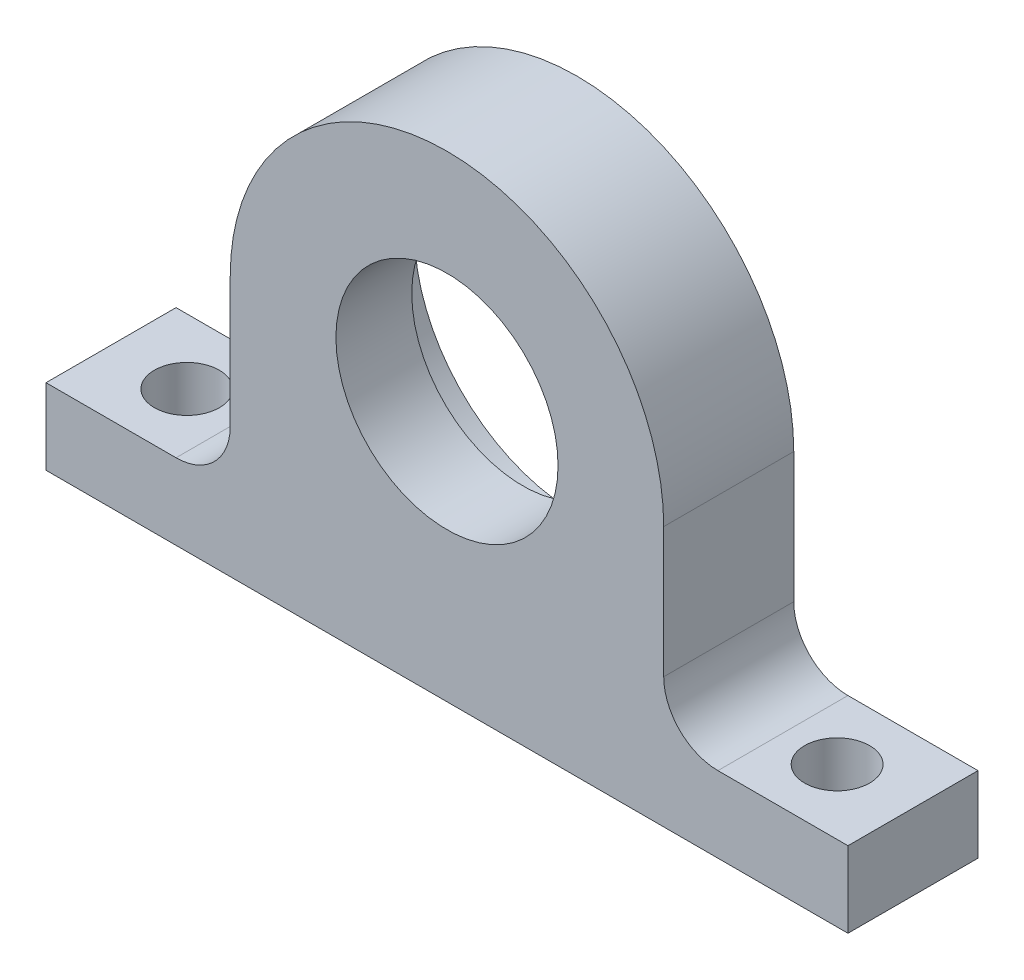
ISO-10303-21;
HEADER;
FILE_DESCRIPTION(('STEP AP214'),'2;1');
FILE_NAME('part.step','',(''),(''),'','','');
FILE_SCHEMA(('AUTOMOTIVE_DESIGN { 1 0 10303 214 1 1 1 1 }'));
ENDSEC;
DATA;
#1=APPLICATION_CONTEXT('core data for automotive mechanical design processes');
#2=APPLICATION_PROTOCOL_DEFINITION('international standard','automotive_design',2000,#1);
#3=PRODUCT_CONTEXT('',#1,'mechanical');
#4=PRODUCT('Part','Part','',(#3));
#5=PRODUCT_RELATED_PRODUCT_CATEGORY('part','',(#4));
#6=PRODUCT_DEFINITION_FORMATION('','',#4);
#7=PRODUCT_DEFINITION_CONTEXT('part definition',#1,'design');
#8=PRODUCT_DEFINITION('design','',#6,#7);
#9=PRODUCT_DEFINITION_SHAPE('','',#8);
#10=(LENGTH_UNIT() NAMED_UNIT(*) SI_UNIT(.MILLI.,.METRE.));
#11=(NAMED_UNIT(*) PLANE_ANGLE_UNIT() SI_UNIT($,.RADIAN.));
#12=(NAMED_UNIT(*) SI_UNIT($,.STERADIAN.) SOLID_ANGLE_UNIT());
#13=UNCERTAINTY_MEASURE_WITH_UNIT(LENGTH_MEASURE(1.E-05),#10,'distance_accuracy_value','');
#14=(GEOMETRIC_REPRESENTATION_CONTEXT(3) GLOBAL_UNCERTAINTY_ASSIGNED_CONTEXT((#13)) GLOBAL_UNIT_ASSIGNED_CONTEXT((#10,
#11,#12)) REPRESENTATION_CONTEXT('',''));
#15=CARTESIAN_POINT('',(0.,0.,0.));
#16=DIRECTION('',(0.,0.,1.));
#17=DIRECTION('',(1.,0.,0.));
#18=AXIS2_PLACEMENT_3D('',#15,#16,#17);
#19=CARTESIAN_POINT('',(0.,0.,12.));
#20=DIRECTION('',(0.,0.,-1.));
#21=DIRECTION('',(-1.,0.,0.));
#22=AXIS2_PLACEMENT_3D('',#19,#20,#21);
#23=CYLINDRICAL_SURFACE('',#22,20.);
#24=CARTESIAN_POINT('',(0.,0.,12.));
#25=DIRECTION('',(0.,0.,1.));
#26=DIRECTION('',(1.,0.,0.));
#27=AXIS2_PLACEMENT_3D('',#24,#25,#26);
#28=CIRCLE('',#27,20.);
#29=CARTESIAN_POINT('',(20.,-1.43982048506075E-13,12.));
#30=VERTEX_POINT('',#29);
#31=CARTESIAN_POINT('',(-20.,-1.35308431126191E-13,12.));
#32=VERTEX_POINT('',#31);
#33=EDGE_CURVE('E120',#30,#32,#28,.T.);
#34=ORIENTED_EDGE('',*,*,#33,.F.);
#35=DIRECTION('',(0.,0.,-1.));
#36=VECTOR('',#35,1.);
#37=CARTESIAN_POINT('',(20.,-1.39659253553725E-13,12.));
#38=LINE('',#37,#36);
#39=CARTESIAN_POINT('',(20.,-1.43982048506075E-13,0.));
#40=VERTEX_POINT('',#39);
#41=EDGE_CURVE('E191',#30,#40,#38,.T.);
#42=ORIENTED_EDGE('',*,*,#41,.T.);
#43=CARTESIAN_POINT('',(0.,0.,0.));
#44=DIRECTION('',(0.,0.,1.));
#45=DIRECTION('',(1.,0.,0.));
#46=AXIS2_PLACEMENT_3D('',#43,#44,#45);
#47=CIRCLE('',#46,20.);
#48=CARTESIAN_POINT('',(-20.,-1.35308431126191E-13,0.));
#49=VERTEX_POINT('',#48);
#50=EDGE_CURVE('E224',#40,#49,#47,.T.);
#51=ORIENTED_EDGE('',*,*,#50,.T.);
#52=DIRECTION('',(0.,0.,-1.));
#53=VECTOR('',#52,1.);
#54=CARTESIAN_POINT('',(-20.,-1.34760666357136E-13,12.));
#55=LINE('',#54,#53);
#56=EDGE_CURVE('E190',#32,#49,#55,.T.);
#57=ORIENTED_EDGE('',*,*,#56,.F.);
#58=EDGE_LOOP('',(#34,#42,#51,#57));
#59=FACE_BOUND('',#58,.T.);
#60=ADVANCED_FACE('F39',(#59),#23,.T.);
#61=CARTESIAN_POINT('',(0.,0.,12.));
#62=DIRECTION('',(0.,0.,-1.));
#63=DIRECTION('',(-1.,0.,0.));
#64=AXIS2_PLACEMENT_3D('',#61,#62,#63);
#65=CYLINDRICAL_SURFACE('',#64,10.25);
#66=CARTESIAN_POINT('',(0.,0.,12.));
#67=DIRECTION('',(0.,0.,1.));
#68=DIRECTION('',(1.,0.,0.));
#69=AXIS2_PLACEMENT_3D('',#66,#67,#68);
#70=CIRCLE('',#69,10.25);
#71=CARTESIAN_POINT('',(10.25,0.,12.));
#72=VERTEX_POINT('',#71);
#73=EDGE_CURVE('E212',#72,#72,#70,.T.);
#74=ORIENTED_EDGE('',*,*,#73,.T.);
#75=EDGE_LOOP('',(#74));
#76=FACE_BOUND('',#75,.T.);
#77=CARTESIAN_POINT('',(0.,0.,5.));
#78=DIRECTION('',(0.,0.,-1.));
#79=DIRECTION('',(-1.,0.,0.));
#80=AXIS2_PLACEMENT_3D('',#77,#78,#79);
#81=CIRCLE('',#80,10.25);
#82=CARTESIAN_POINT('',(-10.25,0.,5.));
#83=VERTEX_POINT('',#82);
#84=EDGE_CURVE('E148',#83,#83,#81,.T.);
#85=ORIENTED_EDGE('',*,*,#84,.T.);
#86=EDGE_LOOP('',(#85));
#87=FACE_BOUND('',#86,.T.);
#88=ADVANCED_FACE('F249',(#76,#87),#65,.F.);
#89=CARTESIAN_POINT('',(0.,0.,12.));
#90=DIRECTION('',(0.,0.,1.));
#91=DIRECTION('',(1.,0.,0.));
#92=AXIS2_PLACEMENT_3D('',#89,#90,#91);
#93=PLANE('',#92);
#94=DIRECTION('',(0.,-1.,0.));
#95=VECTOR('',#94,1.);
#96=CARTESIAN_POINT('',(20.,-1.39659253553725E-13,12.));
#97=LINE('',#96,#95);
#98=CARTESIAN_POINT('',(20.,-12.,12.));
#99=VERTEX_POINT('',#98);
#100=EDGE_CURVE('E194',#30,#99,#97,.T.);
#101=ORIENTED_EDGE('',*,*,#100,.F.);
#102=ORIENTED_EDGE('',*,*,#33,.T.);
#103=DIRECTION('',(0.,1.,0.));
#104=VECTOR('',#103,1.);
#105=CARTESIAN_POINT('',(-20.,-1.34760666357136E-13,12.));
#106=LINE('',#105,#104);
#107=CARTESIAN_POINT('',(-20.,-12.,12.));
#108=VERTEX_POINT('',#107);
#109=EDGE_CURVE('E167',#108,#32,#106,.T.);
#110=ORIENTED_EDGE('',*,*,#109,.F.);
#111=CARTESIAN_POINT('',(-25.,-12.,12.));
#112=DIRECTION('',(0.,0.,1.));
#113=DIRECTION('',(1.,0.,0.));
#114=AXIS2_PLACEMENT_3D('',#111,#112,#113);
#115=CIRCLE('',#114,5.);
#116=CARTESIAN_POINT('',(-25.,-17.,12.));
#117=VERTEX_POINT('',#116);
#118=EDGE_CURVE('E160',#108,#117,#115,.F.);
#119=ORIENTED_EDGE('',*,*,#118,.T.);
#120=DIRECTION('',(-1.,0.,0.));
#121=VECTOR('',#120,1.);
#122=CARTESIAN_POINT('',(-10.5356537528527,-17.,12.));
#123=LINE('',#122,#121);
#124=CARTESIAN_POINT('',(-37.,-17.,12.));
#125=VERTEX_POINT('',#124);
#126=EDGE_CURVE('E164',#117,#125,#123,.T.);
#127=ORIENTED_EDGE('',*,*,#126,.T.);
#128=DIRECTION('',(0.,-1.,0.));
#129=VECTOR('',#128,1.);
#130=CARTESIAN_POINT('',(-37.,-17.,12.));
#131=LINE('',#130,#129);
#132=CARTESIAN_POINT('',(-37.,-24.,12.));
#133=VERTEX_POINT('',#132);
#134=EDGE_CURVE('E175',#125,#133,#131,.T.);
#135=ORIENTED_EDGE('',*,*,#134,.T.);
#136=DIRECTION('',(1.,0.,0.));
#137=VECTOR('',#136,1.);
#138=CARTESIAN_POINT('',(-37.,-24.,12.));
#139=LINE('',#138,#137);
#140=CARTESIAN_POINT('',(37.,-24.,12.));
#141=VERTEX_POINT('',#140);
#142=EDGE_CURVE('E128',#133,#141,#139,.T.);
#143=ORIENTED_EDGE('',*,*,#142,.T.);
#144=DIRECTION('',(0.,1.,0.));
#145=VECTOR('',#144,1.);
#146=CARTESIAN_POINT('',(37.,-17.,12.));
#147=LINE('',#146,#145);
#148=CARTESIAN_POINT('',(37.,-17.,12.));
#149=VERTEX_POINT('',#148);
#150=EDGE_CURVE('E121',#141,#149,#147,.T.);
#151=ORIENTED_EDGE('',*,*,#150,.T.);
#152=DIRECTION('',(-1.,0.,0.));
#153=VECTOR('',#152,1.);
#154=CARTESIAN_POINT('',(10.5356537528527,-17.,12.));
#155=LINE('',#154,#153);
#156=CARTESIAN_POINT('',(25.,-17.,12.));
#157=VERTEX_POINT('',#156);
#158=EDGE_CURVE('E112',#149,#157,#155,.T.);
#159=ORIENTED_EDGE('',*,*,#158,.T.);
#160=CARTESIAN_POINT('',(25.,-12.,12.));
#161=DIRECTION('',(0.,0.,1.));
#162=DIRECTION('',(1.,0.,0.));
#163=AXIS2_PLACEMENT_3D('',#160,#161,#162);
#164=CIRCLE('',#163,5.);
#165=EDGE_CURVE('E11',#157,#99,#164,.F.);
#166=ORIENTED_EDGE('',*,*,#165,.T.);
#167=EDGE_LOOP('',(#101,#102,#110,#119,#127,#135,#143,#151,#159,#166));
#168=FACE_BOUND('',#167,.T.);
#169=ORIENTED_EDGE('',*,*,#73,.F.);
#170=EDGE_LOOP('',(#169));
#171=FACE_BOUND('',#170,.T.);
#172=ADVANCED_FACE('F125',(#168,#171),#93,.T.);
#173=CARTESIAN_POINT('',(0.,0.,0.));
#174=DIRECTION('',(0.,0.,1.));
#175=DIRECTION('',(1.,0.,0.));
#176=AXIS2_PLACEMENT_3D('',#173,#174,#175);
#177=PLANE('',#176);
#178=ORIENTED_EDGE('',*,*,#50,.F.);
#179=DIRECTION('',(0.,-1.,0.));
#180=VECTOR('',#179,1.);
#181=CARTESIAN_POINT('',(20.,-1.39659253553725E-13,0.));
#182=LINE('',#181,#180);
#183=CARTESIAN_POINT('',(20.,-12.,0.));
#184=VERTEX_POINT('',#183);
#185=EDGE_CURVE('E244',#40,#184,#182,.T.);
#186=ORIENTED_EDGE('',*,*,#185,.T.);
#187=CARTESIAN_POINT('',(25.,-12.,0.));
#188=DIRECTION('',(0.,0.,1.));
#189=DIRECTION('',(1.,0.,0.));
#190=AXIS2_PLACEMENT_3D('',#187,#188,#189);
#191=CIRCLE('',#190,5.);
#192=CARTESIAN_POINT('',(25.,-17.,0.));
#193=VERTEX_POINT('',#192);
#194=EDGE_CURVE('E47',#184,#193,#191,.T.);
#195=ORIENTED_EDGE('',*,*,#194,.T.);
#196=DIRECTION('',(-1.,0.,0.));
#197=VECTOR('',#196,1.);
#198=CARTESIAN_POINT('',(10.5356537528527,-17.,0.));
#199=LINE('',#198,#197);
#200=CARTESIAN_POINT('',(37.,-17.,0.));
#201=VERTEX_POINT('',#200);
#202=EDGE_CURVE('E222',#201,#193,#199,.T.);
#203=ORIENTED_EDGE('',*,*,#202,.F.);
#204=DIRECTION('',(0.,1.,0.));
#205=VECTOR('',#204,1.);
#206=CARTESIAN_POINT('',(37.,-17.,0.));
#207=LINE('',#206,#205);
#208=CARTESIAN_POINT('',(37.,-24.,0.));
#209=VERTEX_POINT('',#208);
#210=EDGE_CURVE('E136',#209,#201,#207,.T.);
#211=ORIENTED_EDGE('',*,*,#210,.F.);
#212=DIRECTION('',(1.,0.,0.));
#213=VECTOR('',#212,1.);
#214=CARTESIAN_POINT('',(37.,-24.,0.));
#215=LINE('',#214,#213);
#216=CARTESIAN_POINT('',(-37.,-24.,0.));
#217=VERTEX_POINT('',#216);
#218=EDGE_CURVE('E132',#217,#209,#215,.T.);
#219=ORIENTED_EDGE('',*,*,#218,.F.);
#220=DIRECTION('',(0.,-1.,0.));
#221=VECTOR('',#220,1.);
#222=CARTESIAN_POINT('',(-37.,-17.,0.));
#223=LINE('',#222,#221);
#224=CARTESIAN_POINT('',(-37.,-17.,0.));
#225=VERTEX_POINT('',#224);
#226=EDGE_CURVE('E227',#225,#217,#223,.T.);
#227=ORIENTED_EDGE('',*,*,#226,.F.);
#228=DIRECTION('',(-1.,0.,0.));
#229=VECTOR('',#228,1.);
#230=CARTESIAN_POINT('',(-10.5356537528527,-17.,0.));
#231=LINE('',#230,#229);
#232=CARTESIAN_POINT('',(-25.,-17.,0.));
#233=VERTEX_POINT('',#232);
#234=EDGE_CURVE('E185',#233,#225,#231,.T.);
#235=ORIENTED_EDGE('',*,*,#234,.F.);
#236=CARTESIAN_POINT('',(-25.,-12.,0.));
#237=DIRECTION('',(0.,0.,1.));
#238=DIRECTION('',(1.,0.,0.));
#239=AXIS2_PLACEMENT_3D('',#236,#237,#238);
#240=CIRCLE('',#239,5.);
#241=CARTESIAN_POINT('',(-20.,-12.,0.));
#242=VERTEX_POINT('',#241);
#243=EDGE_CURVE('E158',#233,#242,#240,.T.);
#244=ORIENTED_EDGE('',*,*,#243,.T.);
#245=DIRECTION('',(0.,1.,0.));
#246=VECTOR('',#245,1.);
#247=CARTESIAN_POINT('',(-20.,-1.34760666357136E-13,0.));
#248=LINE('',#247,#246);
#249=EDGE_CURVE('E182',#242,#49,#248,.T.);
#250=ORIENTED_EDGE('',*,*,#249,.T.);
#251=EDGE_LOOP('',(#178,#186,#195,#203,#211,#219,#227,#235,#244,#250));
#252=FACE_BOUND('',#251,.T.);
#253=CARTESIAN_POINT('',(0.,0.,0.));
#254=DIRECTION('',(0.,0.,-1.));
#255=DIRECTION('',(-1.,0.,0.));
#256=AXIS2_PLACEMENT_3D('',#253,#254,#255);
#257=CIRCLE('',#256,15.);
#258=CARTESIAN_POINT('',(-15.,0.,0.));
#259=VERTEX_POINT('',#258);
#260=EDGE_CURVE('E198',#259,#259,#257,.T.);
#261=ORIENTED_EDGE('',*,*,#260,.F.);
#262=EDGE_LOOP('',(#261));
#263=FACE_BOUND('',#262,.T.);
#264=ADVANCED_FACE('F180',(#252,#263),#177,.F.);
#265=CARTESIAN_POINT('',(37.,-17.,12.));
#266=DIRECTION('',(-1.,0.,0.));
#267=DIRECTION('',(0.,-1.,0.));
#268=AXIS2_PLACEMENT_3D('',#265,#266,#267);
#269=PLANE('',#268);
#270=ORIENTED_EDGE('',*,*,#210,.T.);
#271=DIRECTION('',(0.,0.,-1.));
#272=VECTOR('',#271,1.);
#273=CARTESIAN_POINT('',(37.,-17.,12.));
#274=LINE('',#273,#272);
#275=EDGE_CURVE('E116',#149,#201,#274,.T.);
#276=ORIENTED_EDGE('',*,*,#275,.F.);
#277=ORIENTED_EDGE('',*,*,#150,.F.);
#278=DIRECTION('',(0.,0.,-1.));
#279=VECTOR('',#278,1.);
#280=CARTESIAN_POINT('',(37.,-24.,12.));
#281=LINE('',#280,#279);
#282=EDGE_CURVE('E220',#141,#209,#281,.T.);
#283=ORIENTED_EDGE('',*,*,#282,.T.);
#284=EDGE_LOOP('',(#270,#276,#277,#283));
#285=FACE_BOUND('',#284,.T.);
#286=ADVANCED_FACE('F134',(#285),#269,.F.);
#287=CARTESIAN_POINT('',(10.5356537528527,-17.,12.));
#288=DIRECTION('',(0.,-1.,0.));
#289=DIRECTION('',(1.,0.,0.));
#290=AXIS2_PLACEMENT_3D('',#287,#288,#289);
#291=PLANE('',#290);
#292=CARTESIAN_POINT('',(30.,-17.,6.));
#293=DIRECTION('',(0.,1.,0.));
#294=DIRECTION('',(-1.,0.,0.));
#295=AXIS2_PLACEMENT_3D('',#292,#293,#294);
#296=CIRCLE('',#295,3.);
#297=CARTESIAN_POINT('',(27.,-17.,6.));
#298=VERTEX_POINT('',#297);
#299=EDGE_CURVE('E206',#298,#298,#296,.T.);
#300=ORIENTED_EDGE('',*,*,#299,.F.);
#301=EDGE_LOOP('',(#300));
#302=FACE_BOUND('',#301,.T.);
#303=ORIENTED_EDGE('',*,*,#202,.T.);
#304=DIRECTION('',(0.,0.,-1.));
#305=VECTOR('',#304,1.);
#306=CARTESIAN_POINT('',(25.,-17.,12.));
#307=LINE('',#306,#305);
#308=EDGE_CURVE('E54',#193,#157,#307,.F.);
#309=ORIENTED_EDGE('',*,*,#308,.T.);
#310=ORIENTED_EDGE('',*,*,#158,.F.);
#311=ORIENTED_EDGE('',*,*,#275,.T.);
#312=EDGE_LOOP('',(#303,#309,#310,#311));
#313=FACE_BOUND('',#312,.T.);
#314=ADVANCED_FACE('F114',(#302,#313),#291,.F.);
#315=CARTESIAN_POINT('',(-10.5356537528527,-17.,12.));
#316=DIRECTION('',(0.,-1.,0.));
#317=DIRECTION('',(1.,0.,0.));
#318=AXIS2_PLACEMENT_3D('',#315,#316,#317);
#319=PLANE('',#318);
#320=CARTESIAN_POINT('',(-30.,-17.,6.));
#321=DIRECTION('',(0.,1.,0.));
#322=DIRECTION('',(1.,0.,0.));
#323=AXIS2_PLACEMENT_3D('',#320,#321,#322);
#324=CIRCLE('',#323,3.);
#325=CARTESIAN_POINT('',(-27.,-17.,6.));
#326=VERTEX_POINT('',#325);
#327=EDGE_CURVE('E150',#326,#326,#324,.T.);
#328=ORIENTED_EDGE('',*,*,#327,.F.);
#329=EDGE_LOOP('',(#328));
#330=FACE_BOUND('',#329,.T.);
#331=ORIENTED_EDGE('',*,*,#126,.F.);
#332=DIRECTION('',(0.,0.,-1.));
#333=VECTOR('',#332,1.);
#334=CARTESIAN_POINT('',(-25.,-17.,12.));
#335=LINE('',#334,#333);
#336=EDGE_CURVE('E137',#117,#233,#335,.T.);
#337=ORIENTED_EDGE('',*,*,#336,.T.);
#338=ORIENTED_EDGE('',*,*,#234,.T.);
#339=DIRECTION('',(0.,0.,-1.));
#340=VECTOR('',#339,1.);
#341=CARTESIAN_POINT('',(-37.,-17.,12.));
#342=LINE('',#341,#340);
#343=EDGE_CURVE('E138',#125,#225,#342,.T.);
#344=ORIENTED_EDGE('',*,*,#343,.F.);
#345=EDGE_LOOP('',(#331,#337,#338,#344));
#346=FACE_BOUND('',#345,.T.);
#347=ADVANCED_FACE('F172',(#330,#346),#319,.F.);
#348=CARTESIAN_POINT('',(-37.,-17.,12.));
#349=DIRECTION('',(1.,0.,0.));
#350=DIRECTION('',(0.,1.,0.));
#351=AXIS2_PLACEMENT_3D('',#348,#349,#350);
#352=PLANE('',#351);
#353=ORIENTED_EDGE('',*,*,#226,.T.);
#354=DIRECTION('',(0.,0.,-1.));
#355=VECTOR('',#354,1.);
#356=CARTESIAN_POINT('',(-37.,-24.,12.));
#357=LINE('',#356,#355);
#358=EDGE_CURVE('E144',#133,#217,#357,.T.);
#359=ORIENTED_EDGE('',*,*,#358,.F.);
#360=ORIENTED_EDGE('',*,*,#134,.F.);
#361=ORIENTED_EDGE('',*,*,#343,.T.);
#362=EDGE_LOOP('',(#353,#359,#360,#361));
#363=FACE_BOUND('',#362,.T.);
#364=ADVANCED_FACE('F236',(#363),#352,.F.);
#365=CARTESIAN_POINT('',(37.,-24.,12.));
#366=DIRECTION('',(0.,1.,0.));
#367=DIRECTION('',(0.,0.,1.));
#368=AXIS2_PLACEMENT_3D('',#365,#366,#367);
#369=PLANE('',#368);
#370=CARTESIAN_POINT('',(-30.,-24.,6.));
#371=DIRECTION('',(0.,1.,0.));
#372=DIRECTION('',(1.,0.,0.));
#373=AXIS2_PLACEMENT_3D('',#370,#371,#372);
#374=CIRCLE('',#373,3.);
#375=CARTESIAN_POINT('',(-27.,-24.,6.));
#376=VERTEX_POINT('',#375);
#377=EDGE_CURVE('E203',#376,#376,#374,.T.);
#378=ORIENTED_EDGE('',*,*,#377,.T.);
#379=EDGE_LOOP('',(#378));
#380=FACE_BOUND('',#379,.T.);
#381=CARTESIAN_POINT('',(30.,-24.,6.));
#382=DIRECTION('',(0.,1.,0.));
#383=DIRECTION('',(-1.,0.,0.));
#384=AXIS2_PLACEMENT_3D('',#381,#382,#383);
#385=CIRCLE('',#384,3.);
#386=CARTESIAN_POINT('',(27.,-24.,6.));
#387=VERTEX_POINT('',#386);
#388=EDGE_CURVE('E209',#387,#387,#385,.T.);
#389=ORIENTED_EDGE('',*,*,#388,.T.);
#390=EDGE_LOOP('',(#389));
#391=FACE_BOUND('',#390,.T.);
#392=ORIENTED_EDGE('',*,*,#218,.T.);
#393=ORIENTED_EDGE('',*,*,#282,.F.);
#394=ORIENTED_EDGE('',*,*,#142,.F.);
#395=ORIENTED_EDGE('',*,*,#358,.T.);
#396=EDGE_LOOP('',(#392,#393,#394,#395));
#397=FACE_BOUND('',#396,.T.);
#398=ADVANCED_FACE('F234',(#380,#391,#397),#369,.F.);
#399=CARTESIAN_POINT('',(30.,-24.,6.));
#400=DIRECTION('',(0.,1.,0.));
#401=DIRECTION('',(-1.,0.,0.));
#402=AXIS2_PLACEMENT_3D('',#399,#400,#401);
#403=CYLINDRICAL_SURFACE('',#402,3.);
#404=ORIENTED_EDGE('',*,*,#388,.F.);
#405=EDGE_LOOP('',(#404));
#406=FACE_BOUND('',#405,.T.);
#407=ORIENTED_EDGE('',*,*,#299,.T.);
#408=EDGE_LOOP('',(#407));
#409=FACE_BOUND('',#408,.T.);
#410=ADVANCED_FACE('F286',(#406,#409),#403,.F.);
#411=CARTESIAN_POINT('',(-30.,-24.,6.));
#412=DIRECTION('',(0.,1.,0.));
#413=DIRECTION('',(-1.,0.,0.));
#414=AXIS2_PLACEMENT_3D('',#411,#412,#413);
#415=CYLINDRICAL_SURFACE('',#414,3.);
#416=ORIENTED_EDGE('',*,*,#377,.F.);
#417=EDGE_LOOP('',(#416));
#418=FACE_BOUND('',#417,.T.);
#419=ORIENTED_EDGE('',*,*,#327,.T.);
#420=EDGE_LOOP('',(#419));
#421=FACE_BOUND('',#420,.T.);
#422=ADVANCED_FACE('F282',(#418,#421),#415,.F.);
#423=CARTESIAN_POINT('',(0.,0.,5.));
#424=DIRECTION('',(0.,0.,-1.));
#425=DIRECTION('',(-1.,0.,0.));
#426=AXIS2_PLACEMENT_3D('',#423,#424,#425);
#427=CYLINDRICAL_SURFACE('',#426,15.);
#428=CARTESIAN_POINT('',(0.,0.,5.));
#429=DIRECTION('',(0.,0.,-1.));
#430=DIRECTION('',(-1.,0.,0.));
#431=AXIS2_PLACEMENT_3D('',#428,#429,#430);
#432=CIRCLE('',#431,15.);
#433=CARTESIAN_POINT('',(-15.,0.,5.));
#434=VERTEX_POINT('',#433);
#435=EDGE_CURVE('E151',#434,#434,#432,.T.);
#436=ORIENTED_EDGE('',*,*,#435,.F.);
#437=EDGE_LOOP('',(#436));
#438=FACE_BOUND('',#437,.T.);
#439=ORIENTED_EDGE('',*,*,#260,.T.);
#440=EDGE_LOOP('',(#439));
#441=FACE_BOUND('',#440,.T.);
#442=ADVANCED_FACE('F278',(#438,#441),#427,.F.);
#443=CARTESIAN_POINT('',(0.,0.,5.));
#444=DIRECTION('',(0.,0.,-1.));
#445=DIRECTION('',(-1.,0.,0.));
#446=AXIS2_PLACEMENT_3D('',#443,#444,#445);
#447=PLANE('',#446);
#448=ORIENTED_EDGE('',*,*,#84,.F.);
#449=EDGE_LOOP('',(#448));
#450=FACE_BOUND('',#449,.T.);
#451=ORIENTED_EDGE('',*,*,#435,.T.);
#452=EDGE_LOOP('',(#451));
#453=FACE_BOUND('',#452,.T.);
#454=ADVANCED_FACE('F274',(#450,#453),#447,.T.);
#455=CARTESIAN_POINT('',(-20.,-1.34760666357136E-13,12.));
#456=DIRECTION('',(-1.,0.,0.));
#457=DIRECTION('',(0.,-1.,0.));
#458=AXIS2_PLACEMENT_3D('',#455,#456,#457);
#459=PLANE('',#458);
#460=ORIENTED_EDGE('',*,*,#249,.F.);
#461=DIRECTION('',(0.,0.,-1.));
#462=VECTOR('',#461,1.);
#463=CARTESIAN_POINT('',(-20.,-12.,12.));
#464=LINE('',#463,#462);
#465=EDGE_CURVE('E141',#242,#108,#464,.F.);
#466=ORIENTED_EDGE('',*,*,#465,.T.);
#467=ORIENTED_EDGE('',*,*,#109,.T.);
#468=ORIENTED_EDGE('',*,*,#56,.T.);
#469=EDGE_LOOP('',(#460,#466,#467,#468));
#470=FACE_BOUND('',#469,.T.);
#471=ADVANCED_FACE('F188',(#470),#459,.T.);
#472=CARTESIAN_POINT('',(20.,-1.39659253553725E-13,12.));
#473=DIRECTION('',(1.,0.,0.));
#474=DIRECTION('',(0.,1.,0.));
#475=AXIS2_PLACEMENT_3D('',#472,#473,#474);
#476=PLANE('',#475);
#477=ORIENTED_EDGE('',*,*,#100,.T.);
#478=DIRECTION('',(0.,0.,-1.));
#479=VECTOR('',#478,1.);
#480=CARTESIAN_POINT('',(20.,-12.,12.));
#481=LINE('',#480,#479);
#482=EDGE_CURVE('E154',#99,#184,#481,.T.);
#483=ORIENTED_EDGE('',*,*,#482,.T.);
#484=ORIENTED_EDGE('',*,*,#185,.F.);
#485=ORIENTED_EDGE('',*,*,#41,.F.);
#486=EDGE_LOOP('',(#477,#483,#484,#485));
#487=FACE_BOUND('',#486,.T.);
#488=ADVANCED_FACE('F242',(#487),#476,.T.);
#489=CARTESIAN_POINT('',(-25.,-12.,12.));
#490=DIRECTION('',(0.,0.,-1.));
#491=DIRECTION('',(-1.,0.,0.));
#492=AXIS2_PLACEMENT_3D('',#489,#490,#491);
#493=CYLINDRICAL_SURFACE('',#492,5.);
#494=ORIENTED_EDGE('',*,*,#118,.F.);
#495=ORIENTED_EDGE('',*,*,#465,.F.);
#496=ORIENTED_EDGE('',*,*,#243,.F.);
#497=ORIENTED_EDGE('',*,*,#336,.F.);
#498=EDGE_LOOP('',(#494,#495,#496,#497));
#499=FACE_BOUND('',#498,.T.);
#500=ADVANCED_FACE('F177',(#499),#493,.F.);
#501=CARTESIAN_POINT('',(25.,-12.,12.));
#502=DIRECTION('',(0.,0.,-1.));
#503=DIRECTION('',(-1.,0.,0.));
#504=AXIS2_PLACEMENT_3D('',#501,#502,#503);
#505=CYLINDRICAL_SURFACE('',#504,5.);
#506=ORIENTED_EDGE('',*,*,#165,.F.);
#507=ORIENTED_EDGE('',*,*,#308,.F.);
#508=ORIENTED_EDGE('',*,*,#194,.F.);
#509=ORIENTED_EDGE('',*,*,#482,.F.);
#510=EDGE_LOOP('',(#506,#507,#508,#509));
#511=FACE_BOUND('',#510,.T.);
#512=ADVANCED_FACE('F41',(#511),#505,.F.);
#513=CLOSED_SHELL('',(#60,#88,#172,#264,#286,#314,#347,#364,#398,#410,#422,#442,#454,#471,#488,
#500,#512));
#514=MANIFOLD_SOLID_BREP('B2',#513);
#515=ADVANCED_BREP_SHAPE_REPRESENTATION('',(#18,#514),#14);
#516=SHAPE_DEFINITION_REPRESENTATION(#9,#515);
ENDSEC;
END-ISO-10303-21;
